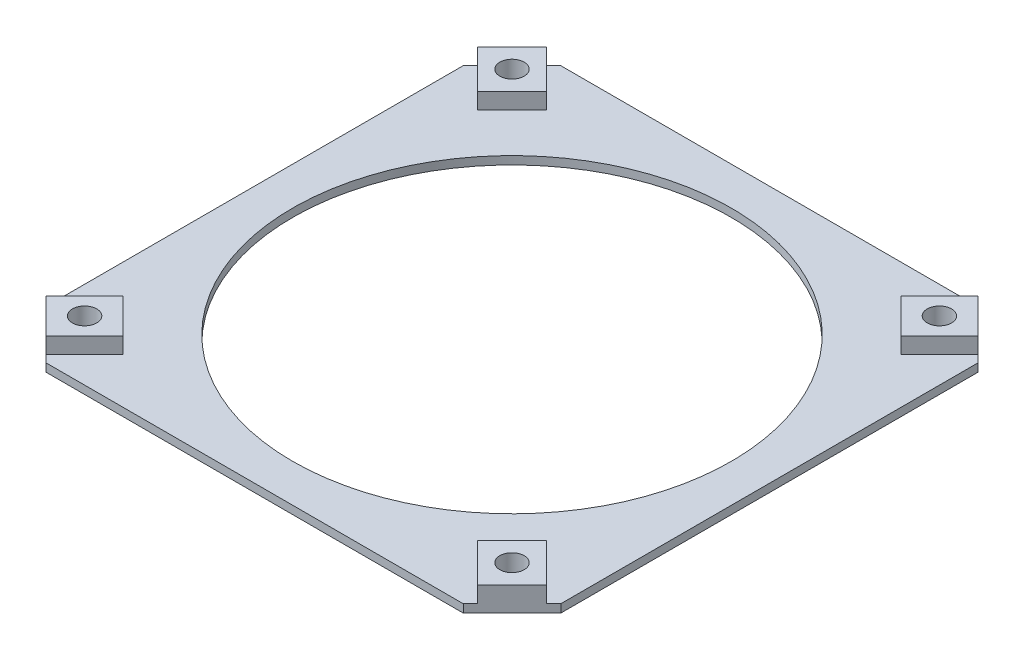
ISO-10303-21;
HEADER;
FILE_DESCRIPTION(('STEP AP214'),'2;1');
FILE_NAME('part.step','',(''),(''),'','','');
FILE_SCHEMA(('AUTOMOTIVE_DESIGN { 1 0 10303 214 1 1 1 1 }'));
ENDSEC;
DATA;
#1=APPLICATION_CONTEXT('core data for automotive mechanical design processes');
#2=APPLICATION_PROTOCOL_DEFINITION('international standard','automotive_design',2000,#1);
#3=PRODUCT_CONTEXT('',#1,'mechanical');
#4=PRODUCT('Part','Part','',(#3));
#5=PRODUCT_RELATED_PRODUCT_CATEGORY('part','',(#4));
#6=PRODUCT_DEFINITION_FORMATION('','',#4);
#7=PRODUCT_DEFINITION_CONTEXT('part definition',#1,'design');
#8=PRODUCT_DEFINITION('design','',#6,#7);
#9=PRODUCT_DEFINITION_SHAPE('','',#8);
#10=(LENGTH_UNIT() NAMED_UNIT(*) SI_UNIT(.MILLI.,.METRE.));
#11=(NAMED_UNIT(*) PLANE_ANGLE_UNIT() SI_UNIT($,.RADIAN.));
#12=(NAMED_UNIT(*) SI_UNIT($,.STERADIAN.) SOLID_ANGLE_UNIT());
#13=UNCERTAINTY_MEASURE_WITH_UNIT(LENGTH_MEASURE(1.E-05),#10,'distance_accuracy_value','');
#14=(GEOMETRIC_REPRESENTATION_CONTEXT(3) GLOBAL_UNCERTAINTY_ASSIGNED_CONTEXT((#13)) GLOBAL_UNIT_ASSIGNED_CONTEXT((#10,
#11,#12)) REPRESENTATION_CONTEXT('',''));
#15=CARTESIAN_POINT('',(0.,0.,0.));
#16=DIRECTION('',(0.,0.,1.));
#17=DIRECTION('',(1.,0.,0.));
#18=AXIS2_PLACEMENT_3D('',#15,#16,#17);
#19=CARTESIAN_POINT('',(0.,1.,0.));
#20=DIRECTION('',(0.,-1.,0.));
#21=DIRECTION('',(0.,0.,-1.));
#22=AXIS2_PLACEMENT_3D('',#19,#20,#21);
#23=PLANE('',#22);
#24=CARTESIAN_POINT('',(0.,1.,0.));
#25=DIRECTION('',(0.,1.,0.));
#26=DIRECTION('',(0.,0.,1.));
#27=AXIS2_PLACEMENT_3D('',#24,#25,#26);
#28=CIRCLE('',#27,27.);
#29=CARTESIAN_POINT('',(0.,1.,27.));
#30=VERTEX_POINT('',#29);
#31=EDGE_CURVE('E356',#30,#30,#28,.T.);
#32=ORIENTED_EDGE('',*,*,#31,.F.);
#33=EDGE_LOOP('',(#32));
#34=FACE_BOUND('',#33,.T.);
#35=DIRECTION('',(0.707106781186546,0.,0.707106781186548));
#36=VECTOR('',#35,1.);
#37=CARTESIAN_POINT('',(-30.7997040994862,1.,-26.557063412367));
#38=LINE('',#37,#36);
#39=CARTESIAN_POINT('',(-30.7997040994862,1.,-26.557063412367));
#40=VERTEX_POINT('',#39);
#41=CARTESIAN_POINT('',(-26.0516811079121,1.,-21.8090404207929));
#42=VERTEX_POINT('',#41);
#43=EDGE_CURVE('E527',#40,#42,#38,.T.);
#44=ORIENTED_EDGE('',*,*,#43,.F.);
#45=DIRECTION('',(-0.707106781186548,0.,0.707106781186548));
#46=VECTOR('',#45,1.);
#47=CARTESIAN_POINT('',(-31.68,1.,-25.6767675118532));
#48=LINE('',#47,#46);
#49=CARTESIAN_POINT('',(-31.68,1.,-25.6767675118532));
#50=VERTEX_POINT('',#49);
#51=EDGE_CURVE('E224',#40,#50,#48,.T.);
#52=ORIENTED_EDGE('',*,*,#51,.T.);
#53=DIRECTION('',(0.,0.,1.));
#54=VECTOR('',#53,1.);
#55=CARTESIAN_POINT('',(-31.68,1.,25.6767675118532));
#56=LINE('',#55,#54);
#57=CARTESIAN_POINT('',(-31.68,1.,25.6767675118532));
#58=VERTEX_POINT('',#57);
#59=EDGE_CURVE('E364',#50,#58,#56,.T.);
#60=ORIENTED_EDGE('',*,*,#59,.T.);
#61=DIRECTION('',(0.707106781186548,0.,0.707106781186548));
#62=VECTOR('',#61,1.);
#63=CARTESIAN_POINT('',(-31.68,1.,25.6767675118532));
#64=LINE('',#63,#62);
#65=CARTESIAN_POINT('',(-30.7997040994863,1.,26.5570634123669));
#66=VERTEX_POINT('',#65);
#67=EDGE_CURVE('E370',#58,#66,#64,.T.);
#68=ORIENTED_EDGE('',*,*,#67,.T.);
#69=DIRECTION('',(-0.707106781186549,0.,0.707106781186546));
#70=VECTOR('',#69,1.);
#71=CARTESIAN_POINT('',(-30.7997040994863,1.,26.5570634123669));
#72=LINE('',#71,#70);
#73=CARTESIAN_POINT('',(-26.0516811079122,1.,21.8090404207929));
#74=VERTEX_POINT('',#73);
#75=EDGE_CURVE('E242',#74,#66,#72,.T.);
#76=ORIENTED_EDGE('',*,*,#75,.F.);
#77=DIRECTION('',(-0.707106781186546,0.,-0.707106781186549));
#78=VECTOR('',#77,1.);
#79=CARTESIAN_POINT('',(-21.8090404207929,1.,26.0516811079121));
#80=LINE('',#79,#78);
#81=CARTESIAN_POINT('',(-21.8090404207929,1.,26.0516811079121));
#82=VERTEX_POINT('',#81);
#83=EDGE_CURVE('E231',#82,#74,#80,.T.);
#84=ORIENTED_EDGE('',*,*,#83,.F.);
#85=DIRECTION('',(0.707106781186549,0.,-0.707106781186546));
#86=VECTOR('',#85,1.);
#87=CARTESIAN_POINT('',(-26.557063412367,1.,30.7997040994862));
#88=LINE('',#87,#86);
#89=CARTESIAN_POINT('',(-26.557063412367,1.,30.7997040994862));
#90=VERTEX_POINT('',#89);
#91=EDGE_CURVE('E226',#90,#82,#88,.T.);
#92=ORIENTED_EDGE('',*,*,#91,.F.);
#93=CARTESIAN_POINT('',(-25.68,1.,31.6767675118532));
#94=VERTEX_POINT('',#93);
#95=EDGE_CURVE('E368',#90,#94,#64,.T.);
#96=ORIENTED_EDGE('',*,*,#95,.T.);
#97=DIRECTION('',(1.,0.,0.));
#98=VECTOR('',#97,1.);
#99=CARTESIAN_POINT('',(-25.68,1.,31.6767675118532));
#100=LINE('',#99,#98);
#101=CARTESIAN_POINT('',(25.68,1.,31.6767675118532));
#102=VERTEX_POINT('',#101);
#103=EDGE_CURVE('E373',#94,#102,#100,.T.);
#104=ORIENTED_EDGE('',*,*,#103,.T.);
#105=DIRECTION('',(0.707106781186548,0.,-0.707106781186548));
#106=VECTOR('',#105,1.);
#107=CARTESIAN_POINT('',(25.68,1.,31.6767675118532));
#108=LINE('',#107,#106);
#109=CARTESIAN_POINT('',(26.5570634123669,1.,30.7997040994863));
#110=VERTEX_POINT('',#109);
#111=EDGE_CURVE('E377',#102,#110,#108,.T.);
#112=ORIENTED_EDGE('',*,*,#111,.T.);
#113=DIRECTION('',(0.707106781186547,0.,0.707106781186549));
#114=VECTOR('',#113,1.);
#115=CARTESIAN_POINT('',(26.5570634123669,1.,30.7997040994863));
#116=LINE('',#115,#114);
#117=CARTESIAN_POINT('',(21.8090404207928,1.,26.0516811079122));
#118=VERTEX_POINT('',#117);
#119=EDGE_CURVE('E279',#118,#110,#116,.T.);
#120=ORIENTED_EDGE('',*,*,#119,.F.);
#121=DIRECTION('',(-0.707106781186549,0.,0.707106781186546));
#122=VECTOR('',#121,1.);
#123=CARTESIAN_POINT('',(26.0516811079121,1.,21.8090404207929));
#124=LINE('',#123,#122);
#125=CARTESIAN_POINT('',(26.0516811079121,1.,21.8090404207929));
#126=VERTEX_POINT('',#125);
#127=EDGE_CURVE('E292',#126,#118,#124,.T.);
#128=ORIENTED_EDGE('',*,*,#127,.F.);
#129=DIRECTION('',(-0.707106781186546,0.,-0.707106781186549));
#130=VECTOR('',#129,1.);
#131=CARTESIAN_POINT('',(30.7997040994862,1.,26.557063412367));
#132=LINE('',#131,#130);
#133=CARTESIAN_POINT('',(30.7997040994862,1.,26.557063412367));
#134=VERTEX_POINT('',#133);
#135=EDGE_CURVE('E273',#134,#126,#132,.T.);
#136=ORIENTED_EDGE('',*,*,#135,.F.);
#137=CARTESIAN_POINT('',(31.68,1.,25.6767675118532));
#138=VERTEX_POINT('',#137);
#139=EDGE_CURVE('E376',#134,#138,#108,.T.);
#140=ORIENTED_EDGE('',*,*,#139,.T.);
#141=DIRECTION('',(0.,0.,-1.));
#142=VECTOR('',#141,1.);
#143=CARTESIAN_POINT('',(31.68,1.,25.6767675118532));
#144=LINE('',#143,#142);
#145=CARTESIAN_POINT('',(31.68,1.,-25.6767675118532));
#146=VERTEX_POINT('',#145);
#147=EDGE_CURVE('E380',#138,#146,#144,.T.);
#148=ORIENTED_EDGE('',*,*,#147,.T.);
#149=DIRECTION('',(-0.707106781186548,0.,-0.707106781186548));
#150=VECTOR('',#149,1.);
#151=CARTESIAN_POINT('',(25.68,1.,-31.6767675118532));
#152=LINE('',#151,#150);
#153=CARTESIAN_POINT('',(30.7997040994863,1.,-26.5570634123669));
#154=VERTEX_POINT('',#153);
#155=EDGE_CURVE('E384',#146,#154,#152,.T.);
#156=ORIENTED_EDGE('',*,*,#155,.T.);
#157=DIRECTION('',(0.707106781186548,0.,-0.707106781186547));
#158=VECTOR('',#157,1.);
#159=CARTESIAN_POINT('',(30.7997040994863,1.,-26.5570634123669));
#160=LINE('',#159,#158);
#161=CARTESIAN_POINT('',(26.0516811079122,1.,-21.8090404207928));
#162=VERTEX_POINT('',#161);
#163=EDGE_CURVE('E320',#162,#154,#160,.T.);
#164=ORIENTED_EDGE('',*,*,#163,.F.);
#165=DIRECTION('',(0.707106781186546,0.,0.707106781186549));
#166=VECTOR('',#165,1.);
#167=CARTESIAN_POINT('',(21.8090404207929,1.,-26.0516811079121));
#168=LINE('',#167,#166);
#169=CARTESIAN_POINT('',(21.8090404207929,1.,-26.0516811079121));
#170=VERTEX_POINT('',#169);
#171=EDGE_CURVE('E333',#170,#162,#168,.T.);
#172=ORIENTED_EDGE('',*,*,#171,.F.);
#173=DIRECTION('',(-0.707106781186549,0.,0.707106781186546));
#174=VECTOR('',#173,1.);
#175=CARTESIAN_POINT('',(26.557063412367,1.,-30.7997040994862));
#176=LINE('',#175,#174);
#177=CARTESIAN_POINT('',(26.557063412367,1.,-30.7997040994862));
#178=VERTEX_POINT('',#177);
#179=EDGE_CURVE('E314',#178,#170,#176,.T.);
#180=ORIENTED_EDGE('',*,*,#179,.F.);
#181=CARTESIAN_POINT('',(25.68,1.,-31.6767675118532));
#182=VERTEX_POINT('',#181);
#183=EDGE_CURVE('E383',#178,#182,#152,.T.);
#184=ORIENTED_EDGE('',*,*,#183,.T.);
#185=DIRECTION('',(-1.,0.,0.));
#186=VECTOR('',#185,1.);
#187=CARTESIAN_POINT('',(-25.68,1.,-31.6767675118532));
#188=LINE('',#187,#186);
#189=CARTESIAN_POINT('',(-25.68,1.,-31.6767675118532));
#190=VERTEX_POINT('',#189);
#191=EDGE_CURVE('E387',#182,#190,#188,.T.);
#192=ORIENTED_EDGE('',*,*,#191,.T.);
#193=CARTESIAN_POINT('',(-26.5570634123669,1.,-30.7997040994863));
#194=VERTEX_POINT('',#193);
#195=EDGE_CURVE('E390',#190,#194,#48,.T.);
#196=ORIENTED_EDGE('',*,*,#195,.T.);
#197=DIRECTION('',(-0.707106781186545,0.,-0.70710678118655));
#198=VECTOR('',#197,1.);
#199=CARTESIAN_POINT('',(-26.5570634123669,1.,-30.7997040994863));
#200=LINE('',#199,#198);
#201=CARTESIAN_POINT('',(-21.8090404207929,1.,-26.0516811079122));
#202=VERTEX_POINT('',#201);
#203=EDGE_CURVE('E60',#202,#194,#200,.T.);
#204=ORIENTED_EDGE('',*,*,#203,.F.);
#205=DIRECTION('',(0.707106781186549,0.,-0.707106781186546));
#206=VECTOR('',#205,1.);
#207=CARTESIAN_POINT('',(-26.0516811079121,1.,-21.8090404207929));
#208=LINE('',#207,#206);
#209=EDGE_CURVE('E55',#42,#202,#208,.T.);
#210=ORIENTED_EDGE('',*,*,#209,.F.);
#211=EDGE_LOOP('',(#44,#52,#60,#68,#76,#84,#92,#96,#104,#112,#120,#128,#136,#140,#148,#156,#164,
#172,#180,#184,#192,#196,#204,#210));
#212=FACE_BOUND('',#211,.T.);
#213=ADVANCED_FACE('F39',(#34,#212),#23,.F.);
#214=CARTESIAN_POINT('',(0.,0.,0.));
#215=DIRECTION('',(0.,-1.,0.));
#216=DIRECTION('',(0.,0.,-1.));
#217=AXIS2_PLACEMENT_3D('',#214,#215,#216);
#218=PLANE('',#217);
#219=CARTESIAN_POINT('',(-26.3043722601397,0.,-26.3043722601395));
#220=DIRECTION('',(0.,1.,0.));
#221=DIRECTION('',(1.,0.,0.));
#222=AXIS2_PLACEMENT_3D('',#219,#220,#221);
#223=CIRCLE('',#222,1.5);
#224=CARTESIAN_POINT('',(-24.8043722601397,0.,-26.3043722601395));
#225=VERTEX_POINT('',#224);
#226=EDGE_CURVE('E537',#225,#225,#223,.T.);
#227=ORIENTED_EDGE('',*,*,#226,.T.);
#228=EDGE_LOOP('',(#227));
#229=FACE_BOUND('',#228,.T.);
#230=CARTESIAN_POINT('',(-26.3043722601396,0.,26.3043722601396));
#231=DIRECTION('',(0.,1.,0.));
#232=DIRECTION('',(0.,0.,-1.));
#233=AXIS2_PLACEMENT_3D('',#230,#231,#232);
#234=CIRCLE('',#233,1.5);
#235=CARTESIAN_POINT('',(-26.3043722601396,0.,24.8043722601396));
#236=VERTEX_POINT('',#235);
#237=EDGE_CURVE('E553',#236,#236,#234,.T.);
#238=ORIENTED_EDGE('',*,*,#237,.T.);
#239=EDGE_LOOP('',(#238));
#240=FACE_BOUND('',#239,.T.);
#241=CARTESIAN_POINT('',(26.3043722601398,0.,26.3043722601393));
#242=DIRECTION('',(0.,1.,0.));
#243=DIRECTION('',(-1.,0.,0.));
#244=AXIS2_PLACEMENT_3D('',#241,#242,#243);
#245=CIRCLE('',#244,1.5);
#246=CARTESIAN_POINT('',(24.8043722601398,0.,26.3043722601393));
#247=VERTEX_POINT('',#246);
#248=EDGE_CURVE('E545',#247,#247,#245,.T.);
#249=ORIENTED_EDGE('',*,*,#248,.T.);
#250=EDGE_LOOP('',(#249));
#251=FACE_BOUND('',#250,.T.);
#252=CARTESIAN_POINT('',(26.3043722601396,0.,-26.3043722601396));
#253=DIRECTION('',(0.,1.,0.));
#254=DIRECTION('',(0.,0.,1.));
#255=AXIS2_PLACEMENT_3D('',#252,#253,#254);
#256=CIRCLE('',#255,1.5);
#257=CARTESIAN_POINT('',(26.3043722601396,0.,-24.8043722601396));
#258=VERTEX_POINT('',#257);
#259=EDGE_CURVE('E529',#258,#258,#256,.T.);
#260=ORIENTED_EDGE('',*,*,#259,.T.);
#261=EDGE_LOOP('',(#260));
#262=FACE_BOUND('',#261,.T.);
#263=DIRECTION('',(0.,0.,1.));
#264=VECTOR('',#263,1.);
#265=CARTESIAN_POINT('',(-31.68,0.,25.6767675118532));
#266=LINE('',#265,#264);
#267=CARTESIAN_POINT('',(-31.68,0.,-25.6767675118532));
#268=VERTEX_POINT('',#267);
#269=CARTESIAN_POINT('',(-31.68,0.,25.6767675118532));
#270=VERTEX_POINT('',#269);
#271=EDGE_CURVE('E360',#268,#270,#266,.T.);
#272=ORIENTED_EDGE('',*,*,#271,.F.);
#273=DIRECTION('',(-0.707106781186548,0.,0.707106781186548));
#274=VECTOR('',#273,1.);
#275=CARTESIAN_POINT('',(-31.68,0.,-25.6767675118532));
#276=LINE('',#275,#274);
#277=CARTESIAN_POINT('',(-25.68,0.,-31.6767675118532));
#278=VERTEX_POINT('',#277);
#279=EDGE_CURVE('E369',#278,#268,#276,.T.);
#280=ORIENTED_EDGE('',*,*,#279,.F.);
#281=DIRECTION('',(-1.,0.,0.));
#282=VECTOR('',#281,1.);
#283=CARTESIAN_POINT('',(-25.68,0.,-31.6767675118532));
#284=LINE('',#283,#282);
#285=CARTESIAN_POINT('',(25.68,0.,-31.6767675118532));
#286=VERTEX_POINT('',#285);
#287=EDGE_CURVE('E412',#286,#278,#284,.T.);
#288=ORIENTED_EDGE('',*,*,#287,.F.);
#289=DIRECTION('',(-0.707106781186548,0.,-0.707106781186548));
#290=VECTOR('',#289,1.);
#291=CARTESIAN_POINT('',(25.68,0.,-31.6767675118532));
#292=LINE('',#291,#290);
#293=CARTESIAN_POINT('',(31.68,0.,-25.6767675118532));
#294=VERTEX_POINT('',#293);
#295=EDGE_CURVE('E409',#294,#286,#292,.T.);
#296=ORIENTED_EDGE('',*,*,#295,.F.);
#297=DIRECTION('',(0.,0.,-1.));
#298=VECTOR('',#297,1.);
#299=CARTESIAN_POINT('',(31.68,0.,25.6767675118532));
#300=LINE('',#299,#298);
#301=CARTESIAN_POINT('',(31.68,0.,25.6767675118532));
#302=VERTEX_POINT('',#301);
#303=EDGE_CURVE('E406',#302,#294,#300,.T.);
#304=ORIENTED_EDGE('',*,*,#303,.F.);
#305=DIRECTION('',(0.707106781186548,0.,-0.707106781186548));
#306=VECTOR('',#305,1.);
#307=CARTESIAN_POINT('',(25.68,0.,31.6767675118532));
#308=LINE('',#307,#306);
#309=CARTESIAN_POINT('',(25.68,0.,31.6767675118532));
#310=VERTEX_POINT('',#309);
#311=EDGE_CURVE('E403',#310,#302,#308,.T.);
#312=ORIENTED_EDGE('',*,*,#311,.F.);
#313=DIRECTION('',(1.,0.,0.));
#314=VECTOR('',#313,1.);
#315=CARTESIAN_POINT('',(-25.68,0.,31.6767675118532));
#316=LINE('',#315,#314);
#317=CARTESIAN_POINT('',(-25.68,0.,31.6767675118532));
#318=VERTEX_POINT('',#317);
#319=EDGE_CURVE('E400',#318,#310,#316,.T.);
#320=ORIENTED_EDGE('',*,*,#319,.F.);
#321=DIRECTION('',(0.707106781186548,0.,0.707106781186548));
#322=VECTOR('',#321,1.);
#323=CARTESIAN_POINT('',(-31.68,0.,25.6767675118532));
#324=LINE('',#323,#322);
#325=EDGE_CURVE('E397',#270,#318,#324,.T.);
#326=ORIENTED_EDGE('',*,*,#325,.F.);
#327=EDGE_LOOP('',(#272,#280,#288,#296,#304,#312,#320,#326));
#328=FACE_BOUND('',#327,.T.);
#329=CARTESIAN_POINT('',(0.,0.,0.));
#330=DIRECTION('',(0.,1.,0.));
#331=DIRECTION('',(0.,0.,1.));
#332=AXIS2_PLACEMENT_3D('',#329,#330,#331);
#333=CIRCLE('',#332,27.);
#334=CARTESIAN_POINT('',(0.,0.,27.));
#335=VERTEX_POINT('',#334);
#336=EDGE_CURVE('E355',#335,#335,#333,.T.);
#337=ORIENTED_EDGE('',*,*,#336,.T.);
#338=EDGE_LOOP('',(#337));
#339=FACE_BOUND('',#338,.T.);
#340=ADVANCED_FACE('F451',(#229,#240,#251,#262,#328,#339),#218,.T.);
#341=CARTESIAN_POINT('',(-31.68,1.,25.6767675118532));
#342=DIRECTION('',(1.,0.,0.));
#343=DIRECTION('',(0.,0.,-1.));
#344=AXIS2_PLACEMENT_3D('',#341,#342,#343);
#345=PLANE('',#344);
#346=ORIENTED_EDGE('',*,*,#271,.T.);
#347=DIRECTION('',(0.,-1.,0.));
#348=VECTOR('',#347,1.);
#349=CARTESIAN_POINT('',(-31.68,1.,25.6767675118532));
#350=LINE('',#349,#348);
#351=EDGE_CURVE('E11',#58,#270,#350,.T.);
#352=ORIENTED_EDGE('',*,*,#351,.F.);
#353=ORIENTED_EDGE('',*,*,#59,.F.);
#354=DIRECTION('',(0.,-1.,0.));
#355=VECTOR('',#354,1.);
#356=CARTESIAN_POINT('',(-31.68,1.,-25.6767675118532));
#357=LINE('',#356,#355);
#358=EDGE_CURVE('E393',#50,#268,#357,.T.);
#359=ORIENTED_EDGE('',*,*,#358,.T.);
#360=EDGE_LOOP('',(#346,#352,#353,#359));
#361=FACE_BOUND('',#360,.T.);
#362=ADVANCED_FACE('F41',(#361),#345,.F.);
#363=CARTESIAN_POINT('',(-31.68,1.,25.6767675118532));
#364=DIRECTION('',(0.707106781186547,0.,-0.707106781186547));
#365=DIRECTION('',(-0.707106781186548,0.,-0.707106781186548));
#366=AXIS2_PLACEMENT_3D('',#363,#364,#365);
#367=PLANE('',#366);
#368=ORIENTED_EDGE('',*,*,#325,.T.);
#369=DIRECTION('',(0.,-1.,0.));
#370=VECTOR('',#369,1.);
#371=CARTESIAN_POINT('',(-25.68,1.,31.6767675118532));
#372=LINE('',#371,#370);
#373=EDGE_CURVE('E48',#94,#318,#372,.T.);
#374=ORIENTED_EDGE('',*,*,#373,.F.);
#375=ORIENTED_EDGE('',*,*,#95,.F.);
#376=DIRECTION('',(0.,-1.,0.));
#377=VECTOR('',#376,1.);
#378=CARTESIAN_POINT('',(-26.557063412367,3.,30.7997040994862));
#379=LINE('',#378,#377);
#380=CARTESIAN_POINT('',(-26.557063412367,3.,30.7997040994862));
#381=VERTEX_POINT('',#380);
#382=EDGE_CURVE('E269',#381,#90,#379,.T.);
#383=ORIENTED_EDGE('',*,*,#382,.F.);
#384=DIRECTION('',(0.707106781186546,0.,0.707106781186549));
#385=VECTOR('',#384,1.);
#386=CARTESIAN_POINT('',(-26.557063412367,3.,30.7997040994862));
#387=LINE('',#386,#385);
#388=CARTESIAN_POINT('',(-30.7997040994863,3.,26.5570634123669));
#389=VERTEX_POINT('',#388);
#390=EDGE_CURVE('E237',#389,#381,#387,.T.);
#391=ORIENTED_EDGE('',*,*,#390,.F.);
#392=DIRECTION('',(0.,-1.,0.));
#393=VECTOR('',#392,1.);
#394=CARTESIAN_POINT('',(-30.7997040994863,3.,26.5570634123669));
#395=LINE('',#394,#393);
#396=EDGE_CURVE('E250',#389,#66,#395,.T.);
#397=ORIENTED_EDGE('',*,*,#396,.T.);
#398=ORIENTED_EDGE('',*,*,#67,.F.);
#399=ORIENTED_EDGE('',*,*,#351,.T.);
#400=EDGE_LOOP('',(#368,#374,#375,#383,#391,#397,#398,#399));
#401=FACE_BOUND('',#400,.T.);
#402=ADVANCED_FACE('F470',(#401),#367,.F.);
#403=CARTESIAN_POINT('',(-25.68,1.,31.6767675118532));
#404=DIRECTION('',(0.,0.,-1.));
#405=DIRECTION('',(-1.,0.,0.));
#406=AXIS2_PLACEMENT_3D('',#403,#404,#405);
#407=PLANE('',#406);
#408=ORIENTED_EDGE('',*,*,#319,.T.);
#409=DIRECTION('',(0.,-1.,0.));
#410=VECTOR('',#409,1.);
#411=CARTESIAN_POINT('',(25.68,1.,31.6767675118532));
#412=LINE('',#411,#410);
#413=EDGE_CURVE('E436',#102,#310,#412,.T.);
#414=ORIENTED_EDGE('',*,*,#413,.F.);
#415=ORIENTED_EDGE('',*,*,#103,.F.);
#416=ORIENTED_EDGE('',*,*,#373,.T.);
#417=EDGE_LOOP('',(#408,#414,#415,#416));
#418=FACE_BOUND('',#417,.T.);
#419=ADVANCED_FACE('F445',(#418),#407,.F.);
#420=CARTESIAN_POINT('',(25.68,1.,31.6767675118532));
#421=DIRECTION('',(-0.707106781186547,0.,-0.707106781186547));
#422=DIRECTION('',(-0.707106781186548,0.,0.707106781186548));
#423=AXIS2_PLACEMENT_3D('',#420,#421,#422);
#424=PLANE('',#423);
#425=ORIENTED_EDGE('',*,*,#311,.T.);
#426=DIRECTION('',(0.,-1.,0.));
#427=VECTOR('',#426,1.);
#428=CARTESIAN_POINT('',(31.68,1.,25.6767675118532));
#429=LINE('',#428,#427);
#430=EDGE_CURVE('E432',#138,#302,#429,.T.);
#431=ORIENTED_EDGE('',*,*,#430,.F.);
#432=ORIENTED_EDGE('',*,*,#139,.F.);
#433=DIRECTION('',(0.,-1.,0.));
#434=VECTOR('',#433,1.);
#435=CARTESIAN_POINT('',(30.7997040994862,3.,26.557063412367));
#436=LINE('',#435,#434);
#437=CARTESIAN_POINT('',(30.7997040994862,3.,26.557063412367));
#438=VERTEX_POINT('',#437);
#439=EDGE_CURVE('E310',#438,#134,#436,.T.);
#440=ORIENTED_EDGE('',*,*,#439,.F.);
#441=DIRECTION('',(0.707106781186548,0.,-0.707106781186547));
#442=VECTOR('',#441,1.);
#443=CARTESIAN_POINT('',(30.7997040994862,3.,26.557063412367));
#444=LINE('',#443,#442);
#445=CARTESIAN_POINT('',(26.5570634123669,3.,30.7997040994863));
#446=VERTEX_POINT('',#445);
#447=EDGE_CURVE('E274',#446,#438,#444,.T.);
#448=ORIENTED_EDGE('',*,*,#447,.F.);
#449=DIRECTION('',(0.,-1.,0.));
#450=VECTOR('',#449,1.);
#451=CARTESIAN_POINT('',(26.5570634123669,3.,30.7997040994863));
#452=LINE('',#451,#450);
#453=EDGE_CURVE('E288',#446,#110,#452,.T.);
#454=ORIENTED_EDGE('',*,*,#453,.T.);
#455=ORIENTED_EDGE('',*,*,#111,.F.);
#456=ORIENTED_EDGE('',*,*,#413,.T.);
#457=EDGE_LOOP('',(#425,#431,#432,#440,#448,#454,#455,#456));
#458=FACE_BOUND('',#457,.T.);
#459=ADVANCED_FACE('F457',(#458),#424,.F.);
#460=CARTESIAN_POINT('',(31.68,1.,25.6767675118532));
#461=DIRECTION('',(-1.,0.,0.));
#462=DIRECTION('',(0.,0.,1.));
#463=AXIS2_PLACEMENT_3D('',#460,#461,#462);
#464=PLANE('',#463);
#465=ORIENTED_EDGE('',*,*,#303,.T.);
#466=DIRECTION('',(0.,-1.,0.));
#467=VECTOR('',#466,1.);
#468=CARTESIAN_POINT('',(31.68,1.,-25.6767675118532));
#469=LINE('',#468,#467);
#470=EDGE_CURVE('E428',#146,#294,#469,.T.);
#471=ORIENTED_EDGE('',*,*,#470,.F.);
#472=ORIENTED_EDGE('',*,*,#147,.F.);
#473=ORIENTED_EDGE('',*,*,#430,.T.);
#474=EDGE_LOOP('',(#465,#471,#472,#473));
#475=FACE_BOUND('',#474,.T.);
#476=ADVANCED_FACE('F461',(#475),#464,.F.);
#477=CARTESIAN_POINT('',(25.68,1.,-31.6767675118532));
#478=DIRECTION('',(-0.707106781186547,0.,0.707106781186547));
#479=DIRECTION('',(0.707106781186548,0.,0.707106781186548));
#480=AXIS2_PLACEMENT_3D('',#477,#478,#479);
#481=PLANE('',#480);
#482=ORIENTED_EDGE('',*,*,#295,.T.);
#483=DIRECTION('',(0.,-1.,0.));
#484=VECTOR('',#483,1.);
#485=CARTESIAN_POINT('',(25.68,1.,-31.6767675118532));
#486=LINE('',#485,#484);
#487=EDGE_CURVE('E424',#182,#286,#486,.T.);
#488=ORIENTED_EDGE('',*,*,#487,.F.);
#489=ORIENTED_EDGE('',*,*,#183,.F.);
#490=DIRECTION('',(0.,-1.,0.));
#491=VECTOR('',#490,1.);
#492=CARTESIAN_POINT('',(26.557063412367,3.,-30.7997040994862));
#493=LINE('',#492,#491);
#494=CARTESIAN_POINT('',(26.557063412367,3.,-30.7997040994862));
#495=VERTEX_POINT('',#494);
#496=EDGE_CURVE('E351',#495,#178,#493,.T.);
#497=ORIENTED_EDGE('',*,*,#496,.F.);
#498=DIRECTION('',(-0.707106781186546,0.,-0.707106781186549));
#499=VECTOR('',#498,1.);
#500=CARTESIAN_POINT('',(26.557063412367,3.,-30.7997040994862));
#501=LINE('',#500,#499);
#502=CARTESIAN_POINT('',(30.7997040994863,3.,-26.5570634123669));
#503=VERTEX_POINT('',#502);
#504=EDGE_CURVE('E315',#503,#495,#501,.T.);
#505=ORIENTED_EDGE('',*,*,#504,.F.);
#506=DIRECTION('',(0.,-1.,0.));
#507=VECTOR('',#506,1.);
#508=CARTESIAN_POINT('',(30.7997040994863,3.,-26.5570634123669));
#509=LINE('',#508,#507);
#510=EDGE_CURVE('E329',#503,#154,#509,.T.);
#511=ORIENTED_EDGE('',*,*,#510,.T.);
#512=ORIENTED_EDGE('',*,*,#155,.F.);
#513=ORIENTED_EDGE('',*,*,#470,.T.);
#514=EDGE_LOOP('',(#482,#488,#489,#497,#505,#511,#512,#513));
#515=FACE_BOUND('',#514,.T.);
#516=ADVANCED_FACE('F496',(#515),#481,.F.);
#517=CARTESIAN_POINT('',(-25.68,1.,-31.6767675118532));
#518=DIRECTION('',(0.,0.,1.));
#519=DIRECTION('',(1.,0.,0.));
#520=AXIS2_PLACEMENT_3D('',#517,#518,#519);
#521=PLANE('',#520);
#522=ORIENTED_EDGE('',*,*,#287,.T.);
#523=DIRECTION('',(0.,-1.,0.));
#524=VECTOR('',#523,1.);
#525=CARTESIAN_POINT('',(-25.68,1.,-31.6767675118532));
#526=LINE('',#525,#524);
#527=EDGE_CURVE('E420',#190,#278,#526,.T.);
#528=ORIENTED_EDGE('',*,*,#527,.F.);
#529=ORIENTED_EDGE('',*,*,#191,.F.);
#530=ORIENTED_EDGE('',*,*,#487,.T.);
#531=EDGE_LOOP('',(#522,#528,#529,#530));
#532=FACE_BOUND('',#531,.T.);
#533=ADVANCED_FACE('F492',(#532),#521,.F.);
#534=CARTESIAN_POINT('',(-31.68,1.,-25.6767675118532));
#535=DIRECTION('',(0.707106781186547,0.,0.707106781186547));
#536=DIRECTION('',(0.707106781186548,0.,-0.707106781186548));
#537=AXIS2_PLACEMENT_3D('',#534,#535,#536);
#538=PLANE('',#537);
#539=ORIENTED_EDGE('',*,*,#279,.T.);
#540=ORIENTED_EDGE('',*,*,#358,.F.);
#541=ORIENTED_EDGE('',*,*,#51,.F.);
#542=DIRECTION('',(0.,-1.,0.));
#543=VECTOR('',#542,1.);
#544=CARTESIAN_POINT('',(-30.7997040994862,3.,-26.557063412367));
#545=LINE('',#544,#543);
#546=CARTESIAN_POINT('',(-30.7997040994862,3.,-26.557063412367));
#547=VERTEX_POINT('',#546);
#548=EDGE_CURVE('E204',#547,#40,#545,.T.);
#549=ORIENTED_EDGE('',*,*,#548,.F.);
#550=DIRECTION('',(-0.707106781186549,0.,0.707106781186546));
#551=VECTOR('',#550,1.);
#552=CARTESIAN_POINT('',(-30.7997040994862,3.,-26.557063412367));
#553=LINE('',#552,#551);
#554=CARTESIAN_POINT('',(-26.5570634123669,3.,-30.7997040994863));
#555=VERTEX_POINT('',#554);
#556=EDGE_CURVE('E211',#555,#547,#553,.T.);
#557=ORIENTED_EDGE('',*,*,#556,.F.);
#558=DIRECTION('',(0.,-1.,0.));
#559=VECTOR('',#558,1.);
#560=CARTESIAN_POINT('',(-26.5570634123669,3.,-30.7997040994863));
#561=LINE('',#560,#559);
#562=EDGE_CURVE('E515',#555,#194,#561,.T.);
#563=ORIENTED_EDGE('',*,*,#562,.T.);
#564=ORIENTED_EDGE('',*,*,#195,.F.);
#565=ORIENTED_EDGE('',*,*,#527,.T.);
#566=EDGE_LOOP('',(#539,#540,#541,#549,#557,#563,#564,#565));
#567=FACE_BOUND('',#566,.T.);
#568=ADVANCED_FACE('F222',(#567),#538,.F.);
#569=CARTESIAN_POINT('',(0.,1.,0.));
#570=DIRECTION('',(0.,-1.,0.));
#571=DIRECTION('',(0.,0.,-1.));
#572=AXIS2_PLACEMENT_3D('',#569,#570,#571);
#573=CYLINDRICAL_SURFACE('',#572,27.);
#574=ORIENTED_EDGE('',*,*,#31,.T.);
#575=EDGE_LOOP('',(#574));
#576=FACE_BOUND('',#575,.T.);
#577=ORIENTED_EDGE('',*,*,#336,.F.);
#578=EDGE_LOOP('',(#577));
#579=FACE_BOUND('',#578,.T.);
#580=ADVANCED_FACE('F594',(#576,#579),#573,.F.);
#581=CARTESIAN_POINT('',(26.557063412367,3.,-30.7997040994862));
#582=DIRECTION('',(0.707106781186546,0.,0.707106781186549));
#583=DIRECTION('',(0.707106781186549,0.,-0.707106781186546));
#584=AXIS2_PLACEMENT_3D('',#581,#582,#583);
#585=PLANE('',#584);
#586=ORIENTED_EDGE('',*,*,#179,.T.);
#587=DIRECTION('',(0.,-1.,0.));
#588=VECTOR('',#587,1.);
#589=CARTESIAN_POINT('',(21.8090404207929,3.,-26.0516811079121));
#590=LINE('',#589,#588);
#591=CARTESIAN_POINT('',(21.8090404207929,3.,-26.0516811079121));
#592=VERTEX_POINT('',#591);
#593=EDGE_CURVE('E347',#592,#170,#590,.T.);
#594=ORIENTED_EDGE('',*,*,#593,.F.);
#595=DIRECTION('',(-0.707106781186549,0.,0.707106781186546));
#596=VECTOR('',#595,1.);
#597=CARTESIAN_POINT('',(26.557063412367,3.,-30.7997040994862));
#598=LINE('',#597,#596);
#599=EDGE_CURVE('E319',#495,#592,#598,.T.);
#600=ORIENTED_EDGE('',*,*,#599,.F.);
#601=ORIENTED_EDGE('',*,*,#496,.T.);
#602=EDGE_LOOP('',(#586,#594,#600,#601));
#603=FACE_BOUND('',#602,.T.);
#604=ADVANCED_FACE('F509',(#603),#585,.F.);
#605=CARTESIAN_POINT('',(21.8090404207929,3.,-26.0516811079121));
#606=DIRECTION('',(0.707106781186549,0.,-0.707106781186546));
#607=DIRECTION('',(-0.707106781186546,0.,-0.707106781186549));
#608=AXIS2_PLACEMENT_3D('',#605,#606,#607);
#609=PLANE('',#608);
#610=ORIENTED_EDGE('',*,*,#171,.T.);
#611=DIRECTION('',(0.,-1.,0.));
#612=VECTOR('',#611,1.);
#613=CARTESIAN_POINT('',(26.0516811079122,3.,-21.8090404207928));
#614=LINE('',#613,#612);
#615=CARTESIAN_POINT('',(26.0516811079122,3.,-21.8090404207928));
#616=VERTEX_POINT('',#615);
#617=EDGE_CURVE('E343',#616,#162,#614,.T.);
#618=ORIENTED_EDGE('',*,*,#617,.F.);
#619=DIRECTION('',(0.707106781186546,0.,0.707106781186549));
#620=VECTOR('',#619,1.);
#621=CARTESIAN_POINT('',(21.8090404207929,3.,-26.0516811079121));
#622=LINE('',#621,#620);
#623=EDGE_CURVE('E323',#592,#616,#622,.T.);
#624=ORIENTED_EDGE('',*,*,#623,.F.);
#625=ORIENTED_EDGE('',*,*,#593,.T.);
#626=EDGE_LOOP('',(#610,#618,#624,#625));
#627=FACE_BOUND('',#626,.T.);
#628=ADVANCED_FACE('F505',(#627),#609,.F.);
#629=CARTESIAN_POINT('',(30.7997040994863,3.,-26.5570634123669));
#630=DIRECTION('',(-0.707106781186547,0.,-0.707106781186548));
#631=DIRECTION('',(-0.707106781186548,0.,0.707106781186547));
#632=AXIS2_PLACEMENT_3D('',#629,#630,#631);
#633=PLANE('',#632);
#634=ORIENTED_EDGE('',*,*,#163,.T.);
#635=ORIENTED_EDGE('',*,*,#510,.F.);
#636=DIRECTION('',(0.707106781186548,0.,-0.707106781186547));
#637=VECTOR('',#636,1.);
#638=CARTESIAN_POINT('',(30.7997040994863,3.,-26.5570634123669));
#639=LINE('',#638,#637);
#640=EDGE_CURVE('E326',#616,#503,#639,.T.);
#641=ORIENTED_EDGE('',*,*,#640,.F.);
#642=ORIENTED_EDGE('',*,*,#617,.T.);
#643=EDGE_LOOP('',(#634,#635,#641,#642));
#644=FACE_BOUND('',#643,.T.);
#645=ADVANCED_FACE('F502',(#644),#633,.F.);
#646=CARTESIAN_POINT('',(0.,3.,0.));
#647=DIRECTION('',(0.,-1.,0.));
#648=DIRECTION('',(0.,0.,-1.));
#649=AXIS2_PLACEMENT_3D('',#646,#647,#648);
#650=PLANE('',#649);
#651=CARTESIAN_POINT('',(26.3043722601396,3.,-26.3043722601396));
#652=DIRECTION('',(0.,1.,0.));
#653=DIRECTION('',(0.,0.,1.));
#654=AXIS2_PLACEMENT_3D('',#651,#652,#653);
#655=CIRCLE('',#654,1.5);
#656=CARTESIAN_POINT('',(26.3043722601396,3.,-24.8043722601396));
#657=VERTEX_POINT('',#656);
#658=EDGE_CURVE('E533',#657,#657,#655,.T.);
#659=ORIENTED_EDGE('',*,*,#658,.F.);
#660=EDGE_LOOP('',(#659));
#661=FACE_BOUND('',#660,.T.);
#662=ORIENTED_EDGE('',*,*,#504,.T.);
#663=ORIENTED_EDGE('',*,*,#599,.T.);
#664=ORIENTED_EDGE('',*,*,#623,.T.);
#665=ORIENTED_EDGE('',*,*,#640,.T.);
#666=EDGE_LOOP('',(#662,#663,#664,#665));
#667=FACE_BOUND('',#666,.T.);
#668=ADVANCED_FACE('F709',(#661,#667),#650,.F.);
#669=CARTESIAN_POINT('',(30.7997040994862,3.,26.557063412367));
#670=DIRECTION('',(-0.707106781186549,0.,0.707106781186546));
#671=DIRECTION('',(0.707106781186546,0.,0.707106781186549));
#672=AXIS2_PLACEMENT_3D('',#669,#670,#671);
#673=PLANE('',#672);
#674=ORIENTED_EDGE('',*,*,#135,.T.);
#675=DIRECTION('',(0.,-1.,0.));
#676=VECTOR('',#675,1.);
#677=CARTESIAN_POINT('',(26.0516811079121,3.,21.8090404207929));
#678=LINE('',#677,#676);
#679=CARTESIAN_POINT('',(26.0516811079121,3.,21.8090404207929));
#680=VERTEX_POINT('',#679);
#681=EDGE_CURVE('E306',#680,#126,#678,.T.);
#682=ORIENTED_EDGE('',*,*,#681,.F.);
#683=DIRECTION('',(-0.707106781186546,0.,-0.707106781186549));
#684=VECTOR('',#683,1.);
#685=CARTESIAN_POINT('',(30.7997040994862,3.,26.557063412367));
#686=LINE('',#685,#684);
#687=EDGE_CURVE('E278',#438,#680,#686,.T.);
#688=ORIENTED_EDGE('',*,*,#687,.F.);
#689=ORIENTED_EDGE('',*,*,#439,.T.);
#690=EDGE_LOOP('',(#674,#682,#688,#689));
#691=FACE_BOUND('',#690,.T.);
#692=ADVANCED_FACE('F694',(#691),#673,.F.);
#693=CARTESIAN_POINT('',(26.0516811079121,3.,21.8090404207929));
#694=DIRECTION('',(0.707106781186546,0.,0.707106781186549));
#695=DIRECTION('',(0.707106781186549,0.,-0.707106781186546));
#696=AXIS2_PLACEMENT_3D('',#693,#694,#695);
#697=PLANE('',#696);
#698=ORIENTED_EDGE('',*,*,#127,.T.);
#699=DIRECTION('',(0.,-1.,0.));
#700=VECTOR('',#699,1.);
#701=CARTESIAN_POINT('',(21.8090404207928,3.,26.0516811079122));
#702=LINE('',#701,#700);
#703=CARTESIAN_POINT('',(21.8090404207928,3.,26.0516811079122));
#704=VERTEX_POINT('',#703);
#705=EDGE_CURVE('E302',#704,#118,#702,.T.);
#706=ORIENTED_EDGE('',*,*,#705,.F.);
#707=DIRECTION('',(-0.707106781186549,0.,0.707106781186546));
#708=VECTOR('',#707,1.);
#709=CARTESIAN_POINT('',(26.0516811079121,3.,21.8090404207929));
#710=LINE('',#709,#708);
#711=EDGE_CURVE('E282',#680,#704,#710,.T.);
#712=ORIENTED_EDGE('',*,*,#711,.F.);
#713=ORIENTED_EDGE('',*,*,#681,.T.);
#714=EDGE_LOOP('',(#698,#706,#712,#713));
#715=FACE_BOUND('',#714,.T.);
#716=ADVANCED_FACE('F698',(#715),#697,.F.);
#717=CARTESIAN_POINT('',(26.5570634123669,3.,30.7997040994863));
#718=DIRECTION('',(0.707106781186549,0.,-0.707106781186547));
#719=DIRECTION('',(-0.707106781186547,0.,-0.707106781186549));
#720=AXIS2_PLACEMENT_3D('',#717,#718,#719);
#721=PLANE('',#720);
#722=ORIENTED_EDGE('',*,*,#119,.T.);
#723=ORIENTED_EDGE('',*,*,#453,.F.);
#724=DIRECTION('',(0.707106781186547,0.,0.707106781186549));
#725=VECTOR('',#724,1.);
#726=CARTESIAN_POINT('',(26.5570634123669,3.,30.7997040994863));
#727=LINE('',#726,#725);
#728=EDGE_CURVE('E285',#704,#446,#727,.T.);
#729=ORIENTED_EDGE('',*,*,#728,.F.);
#730=ORIENTED_EDGE('',*,*,#705,.T.);
#731=EDGE_LOOP('',(#722,#723,#729,#730));
#732=FACE_BOUND('',#731,.T.);
#733=ADVANCED_FACE('F633',(#732),#721,.F.);
#734=CARTESIAN_POINT('',(0.,3.,0.));
#735=DIRECTION('',(0.,-1.,0.));
#736=DIRECTION('',(0.,0.,-1.));
#737=AXIS2_PLACEMENT_3D('',#734,#735,#736);
#738=PLANE('',#737);
#739=CARTESIAN_POINT('',(26.3043722601398,3.,26.3043722601393));
#740=DIRECTION('',(0.,1.,0.));
#741=DIRECTION('',(-1.,0.,0.));
#742=AXIS2_PLACEMENT_3D('',#739,#740,#741);
#743=CIRCLE('',#742,1.5);
#744=CARTESIAN_POINT('',(24.8043722601398,3.,26.3043722601393));
#745=VERTEX_POINT('',#744);
#746=EDGE_CURVE('E541',#745,#745,#743,.T.);
#747=ORIENTED_EDGE('',*,*,#746,.F.);
#748=EDGE_LOOP('',(#747));
#749=FACE_BOUND('',#748,.T.);
#750=ORIENTED_EDGE('',*,*,#447,.T.);
#751=ORIENTED_EDGE('',*,*,#687,.T.);
#752=ORIENTED_EDGE('',*,*,#711,.T.);
#753=ORIENTED_EDGE('',*,*,#728,.T.);
#754=EDGE_LOOP('',(#750,#751,#752,#753));
#755=FACE_BOUND('',#754,.T.);
#756=ADVANCED_FACE('F628',(#749,#755),#738,.F.);
#757=CARTESIAN_POINT('',(-26.557063412367,3.,30.7997040994862));
#758=DIRECTION('',(-0.707106781186546,0.,-0.707106781186549));
#759=DIRECTION('',(-0.707106781186549,0.,0.707106781186546));
#760=AXIS2_PLACEMENT_3D('',#757,#758,#759);
#761=PLANE('',#760);
#762=ORIENTED_EDGE('',*,*,#91,.T.);
#763=DIRECTION('',(0.,-1.,0.));
#764=VECTOR('',#763,1.);
#765=CARTESIAN_POINT('',(-21.8090404207929,3.,26.0516811079121));
#766=LINE('',#765,#764);
#767=CARTESIAN_POINT('',(-21.8090404207929,3.,26.0516811079121));
#768=VERTEX_POINT('',#767);
#769=EDGE_CURVE('E265',#768,#82,#766,.T.);
#770=ORIENTED_EDGE('',*,*,#769,.F.);
#771=DIRECTION('',(0.707106781186549,0.,-0.707106781186546));
#772=VECTOR('',#771,1.);
#773=CARTESIAN_POINT('',(-26.557063412367,3.,30.7997040994862));
#774=LINE('',#773,#772);
#775=EDGE_CURVE('E241',#381,#768,#774,.T.);
#776=ORIENTED_EDGE('',*,*,#775,.F.);
#777=ORIENTED_EDGE('',*,*,#382,.T.);
#778=EDGE_LOOP('',(#762,#770,#776,#777));
#779=FACE_BOUND('',#778,.T.);
#780=ADVANCED_FACE('F473',(#779),#761,.F.);
#781=CARTESIAN_POINT('',(-21.8090404207929,3.,26.0516811079121));
#782=DIRECTION('',(-0.707106781186549,0.,0.707106781186546));
#783=DIRECTION('',(0.707106781186546,0.,0.707106781186549));
#784=AXIS2_PLACEMENT_3D('',#781,#782,#783);
#785=PLANE('',#784);
#786=ORIENTED_EDGE('',*,*,#83,.T.);
#787=DIRECTION('',(0.,-1.,0.));
#788=VECTOR('',#787,1.);
#789=CARTESIAN_POINT('',(-26.0516811079122,3.,21.8090404207929));
#790=LINE('',#789,#788);
#791=CARTESIAN_POINT('',(-26.0516811079122,3.,21.8090404207929));
#792=VERTEX_POINT('',#791);
#793=EDGE_CURVE('E261',#792,#74,#790,.T.);
#794=ORIENTED_EDGE('',*,*,#793,.F.);
#795=DIRECTION('',(-0.707106781186546,0.,-0.707106781186549));
#796=VECTOR('',#795,1.);
#797=CARTESIAN_POINT('',(-21.8090404207929,3.,26.0516811079121));
#798=LINE('',#797,#796);
#799=EDGE_CURVE('E245',#768,#792,#798,.T.);
#800=ORIENTED_EDGE('',*,*,#799,.F.);
#801=ORIENTED_EDGE('',*,*,#769,.T.);
#802=EDGE_LOOP('',(#786,#794,#800,#801));
#803=FACE_BOUND('',#802,.T.);
#804=ADVANCED_FACE('F819',(#803),#785,.F.);
#805=CARTESIAN_POINT('',(-30.7997040994863,3.,26.5570634123669));
#806=DIRECTION('',(0.707106781186546,0.,0.707106781186549));
#807=DIRECTION('',(0.707106781186549,0.,-0.707106781186546));
#808=AXIS2_PLACEMENT_3D('',#805,#806,#807);
#809=PLANE('',#808);
#810=ORIENTED_EDGE('',*,*,#75,.T.);
#811=ORIENTED_EDGE('',*,*,#396,.F.);
#812=DIRECTION('',(-0.707106781186549,0.,0.707106781186546));
#813=VECTOR('',#812,1.);
#814=CARTESIAN_POINT('',(-30.7997040994863,3.,26.5570634123669));
#815=LINE('',#814,#813);
#816=EDGE_CURVE('E248',#792,#389,#815,.T.);
#817=ORIENTED_EDGE('',*,*,#816,.F.);
#818=ORIENTED_EDGE('',*,*,#793,.T.);
#819=EDGE_LOOP('',(#810,#811,#817,#818));
#820=FACE_BOUND('',#819,.T.);
#821=ADVANCED_FACE('F482',(#820),#809,.F.);
#822=CARTESIAN_POINT('',(0.,3.,0.));
#823=DIRECTION('',(0.,-1.,0.));
#824=DIRECTION('',(0.,0.,-1.));
#825=AXIS2_PLACEMENT_3D('',#822,#823,#824);
#826=PLANE('',#825);
#827=CARTESIAN_POINT('',(-26.3043722601396,3.,26.3043722601396));
#828=DIRECTION('',(0.,1.,0.));
#829=DIRECTION('',(0.,0.,-1.));
#830=AXIS2_PLACEMENT_3D('',#827,#828,#829);
#831=CIRCLE('',#830,1.5);
#832=CARTESIAN_POINT('',(-26.3043722601396,3.,24.8043722601396));
#833=VERTEX_POINT('',#832);
#834=EDGE_CURVE('E549',#833,#833,#831,.T.);
#835=ORIENTED_EDGE('',*,*,#834,.F.);
#836=EDGE_LOOP('',(#835));
#837=FACE_BOUND('',#836,.T.);
#838=ORIENTED_EDGE('',*,*,#390,.T.);
#839=ORIENTED_EDGE('',*,*,#775,.T.);
#840=ORIENTED_EDGE('',*,*,#799,.T.);
#841=ORIENTED_EDGE('',*,*,#816,.T.);
#842=EDGE_LOOP('',(#838,#839,#840,#841));
#843=FACE_BOUND('',#842,.T.);
#844=ADVANCED_FACE('F477',(#837,#843),#826,.F.);
#845=CARTESIAN_POINT('',(-30.7997040994862,3.,-26.557063412367));
#846=DIRECTION('',(0.707106781186549,0.,-0.707106781186547));
#847=DIRECTION('',(-0.707106781186546,0.,-0.707106781186549));
#848=AXIS2_PLACEMENT_3D('',#845,#846,#847);
#849=PLANE('',#848);
#850=ORIENTED_EDGE('',*,*,#43,.T.);
#851=DIRECTION('',(0.,-1.,0.));
#852=VECTOR('',#851,1.);
#853=CARTESIAN_POINT('',(-26.0516811079121,3.,-21.8090404207929));
#854=LINE('',#853,#852);
#855=CARTESIAN_POINT('',(-26.0516811079121,3.,-21.8090404207929));
#856=VERTEX_POINT('',#855);
#857=EDGE_CURVE('E206',#856,#42,#854,.T.);
#858=ORIENTED_EDGE('',*,*,#857,.F.);
#859=DIRECTION('',(0.707106781186546,0.,0.707106781186548));
#860=VECTOR('',#859,1.);
#861=CARTESIAN_POINT('',(-30.7997040994862,3.,-26.557063412367));
#862=LINE('',#861,#860);
#863=EDGE_CURVE('E200',#547,#856,#862,.T.);
#864=ORIENTED_EDGE('',*,*,#863,.F.);
#865=ORIENTED_EDGE('',*,*,#548,.T.);
#866=EDGE_LOOP('',(#850,#858,#864,#865));
#867=FACE_BOUND('',#866,.T.);
#868=ADVANCED_FACE('F202',(#867),#849,.F.);
#869=CARTESIAN_POINT('',(-26.0516811079121,3.,-21.8090404207929));
#870=DIRECTION('',(-0.707106781186546,0.,-0.707106781186549));
#871=DIRECTION('',(-0.707106781186549,0.,0.707106781186546));
#872=AXIS2_PLACEMENT_3D('',#869,#870,#871);
#873=PLANE('',#872);
#874=ORIENTED_EDGE('',*,*,#209,.T.);
#875=DIRECTION('',(0.,-1.,0.));
#876=VECTOR('',#875,1.);
#877=CARTESIAN_POINT('',(-21.8090404207929,3.,-26.0516811079122));
#878=LINE('',#877,#876);
#879=CARTESIAN_POINT('',(-21.8090404207929,3.,-26.0516811079122));
#880=VERTEX_POINT('',#879);
#881=EDGE_CURVE('E233',#880,#202,#878,.T.);
#882=ORIENTED_EDGE('',*,*,#881,.F.);
#883=DIRECTION('',(0.707106781186549,0.,-0.707106781186546));
#884=VECTOR('',#883,1.);
#885=CARTESIAN_POINT('',(-26.0516811079121,3.,-21.8090404207929));
#886=LINE('',#885,#884);
#887=EDGE_CURVE('E210',#856,#880,#886,.T.);
#888=ORIENTED_EDGE('',*,*,#887,.F.);
#889=ORIENTED_EDGE('',*,*,#857,.T.);
#890=EDGE_LOOP('',(#874,#882,#888,#889));
#891=FACE_BOUND('',#890,.T.);
#892=ADVANCED_FACE('F583',(#891),#873,.F.);
#893=CARTESIAN_POINT('',(-26.5570634123669,3.,-30.7997040994863));
#894=DIRECTION('',(-0.70710678118655,0.,0.707106781186545));
#895=DIRECTION('',(0.707106781186545,0.,0.70710678118655));
#896=AXIS2_PLACEMENT_3D('',#893,#894,#895);
#897=PLANE('',#896);
#898=ORIENTED_EDGE('',*,*,#203,.T.);
#899=ORIENTED_EDGE('',*,*,#562,.F.);
#900=DIRECTION('',(-0.707106781186545,0.,-0.70710678118655));
#901=VECTOR('',#900,1.);
#902=CARTESIAN_POINT('',(-26.5570634123669,3.,-30.7997040994863));
#903=LINE('',#902,#901);
#904=EDGE_CURVE('E216',#880,#555,#903,.T.);
#905=ORIENTED_EDGE('',*,*,#904,.F.);
#906=ORIENTED_EDGE('',*,*,#881,.T.);
#907=EDGE_LOOP('',(#898,#899,#905,#906));
#908=FACE_BOUND('',#907,.T.);
#909=ADVANCED_FACE('F514',(#908),#897,.F.);
#910=CARTESIAN_POINT('',(0.,3.,0.));
#911=DIRECTION('',(0.,-1.,0.));
#912=DIRECTION('',(0.,0.,-1.));
#913=AXIS2_PLACEMENT_3D('',#910,#911,#912);
#914=PLANE('',#913);
#915=CARTESIAN_POINT('',(-26.3043722601397,3.,-26.3043722601395));
#916=DIRECTION('',(0.,1.,0.));
#917=DIRECTION('',(1.,0.,0.));
#918=AXIS2_PLACEMENT_3D('',#915,#916,#917);
#919=CIRCLE('',#918,1.5);
#920=CARTESIAN_POINT('',(-24.8043722601397,3.,-26.3043722601395));
#921=VERTEX_POINT('',#920);
#922=EDGE_CURVE('E557',#921,#921,#919,.T.);
#923=ORIENTED_EDGE('',*,*,#922,.F.);
#924=EDGE_LOOP('',(#923));
#925=FACE_BOUND('',#924,.T.);
#926=ORIENTED_EDGE('',*,*,#556,.T.);
#927=ORIENTED_EDGE('',*,*,#863,.T.);
#928=ORIENTED_EDGE('',*,*,#887,.T.);
#929=ORIENTED_EDGE('',*,*,#904,.T.);
#930=EDGE_LOOP('',(#926,#927,#928,#929));
#931=FACE_BOUND('',#930,.T.);
#932=ADVANCED_FACE('F214',(#925,#931),#914,.F.);
#933=CARTESIAN_POINT('',(26.3043722601396,0.,-26.3043722601396));
#934=DIRECTION('',(0.,1.,0.));
#935=DIRECTION('',(0.,0.,1.));
#936=AXIS2_PLACEMENT_3D('',#933,#934,#935);
#937=CYLINDRICAL_SURFACE('',#936,1.5);
#938=ORIENTED_EDGE('',*,*,#259,.F.);
#939=EDGE_LOOP('',(#938));
#940=FACE_BOUND('',#939,.T.);
#941=ORIENTED_EDGE('',*,*,#658,.T.);
#942=EDGE_LOOP('',(#941));
#943=FACE_BOUND('',#942,.T.);
#944=ADVANCED_FACE('F571',(#940,#943),#937,.F.);
#945=CARTESIAN_POINT('',(-26.3043722601397,0.,-26.3043722601395));
#946=DIRECTION('',(0.,1.,0.));
#947=DIRECTION('',(0.,0.,1.));
#948=AXIS2_PLACEMENT_3D('',#945,#946,#947);
#949=CYLINDRICAL_SURFACE('',#948,1.5);
#950=ORIENTED_EDGE('',*,*,#226,.F.);
#951=EDGE_LOOP('',(#950));
#952=FACE_BOUND('',#951,.T.);
#953=ORIENTED_EDGE('',*,*,#922,.T.);
#954=EDGE_LOOP('',(#953));
#955=FACE_BOUND('',#954,.T.);
#956=ADVANCED_FACE('F567',(#952,#955),#949,.F.);
#957=CARTESIAN_POINT('',(-26.3043722601396,0.,26.3043722601396));
#958=DIRECTION('',(0.,1.,0.));
#959=DIRECTION('',(0.,0.,1.));
#960=AXIS2_PLACEMENT_3D('',#957,#958,#959);
#961=CYLINDRICAL_SURFACE('',#960,1.5);
#962=ORIENTED_EDGE('',*,*,#237,.F.);
#963=EDGE_LOOP('',(#962));
#964=FACE_BOUND('',#963,.T.);
#965=ORIENTED_EDGE('',*,*,#834,.T.);
#966=EDGE_LOOP('',(#965));
#967=FACE_BOUND('',#966,.T.);
#968=ADVANCED_FACE('F570',(#964,#967),#961,.F.);
#969=CARTESIAN_POINT('',(26.3043722601398,0.,26.3043722601393));
#970=DIRECTION('',(0.,1.,0.));
#971=DIRECTION('',(0.,0.,1.));
#972=AXIS2_PLACEMENT_3D('',#969,#970,#971);
#973=CYLINDRICAL_SURFACE('',#972,1.5);
#974=ORIENTED_EDGE('',*,*,#248,.F.);
#975=EDGE_LOOP('',(#974));
#976=FACE_BOUND('',#975,.T.);
#977=ORIENTED_EDGE('',*,*,#746,.T.);
#978=EDGE_LOOP('',(#977));
#979=FACE_BOUND('',#978,.T.);
#980=ADVANCED_FACE('F671',(#976,#979),#973,.F.);
#981=CLOSED_SHELL('',(#213,#340,#362,#402,#419,#459,#476,#516,#533,#568,#580,#604,#628,#645,
#668,#692,#716,#733,#756,#780,#804,#821,#844,#868,#892,#909,#932,#944,#956,#968,#980));
#982=MANIFOLD_SOLID_BREP('B2',#981);
#983=ADVANCED_BREP_SHAPE_REPRESENTATION('',(#18,#982),#14);
#984=SHAPE_DEFINITION_REPRESENTATION(#9,#983);
ENDSEC;
END-ISO-10303-21;
